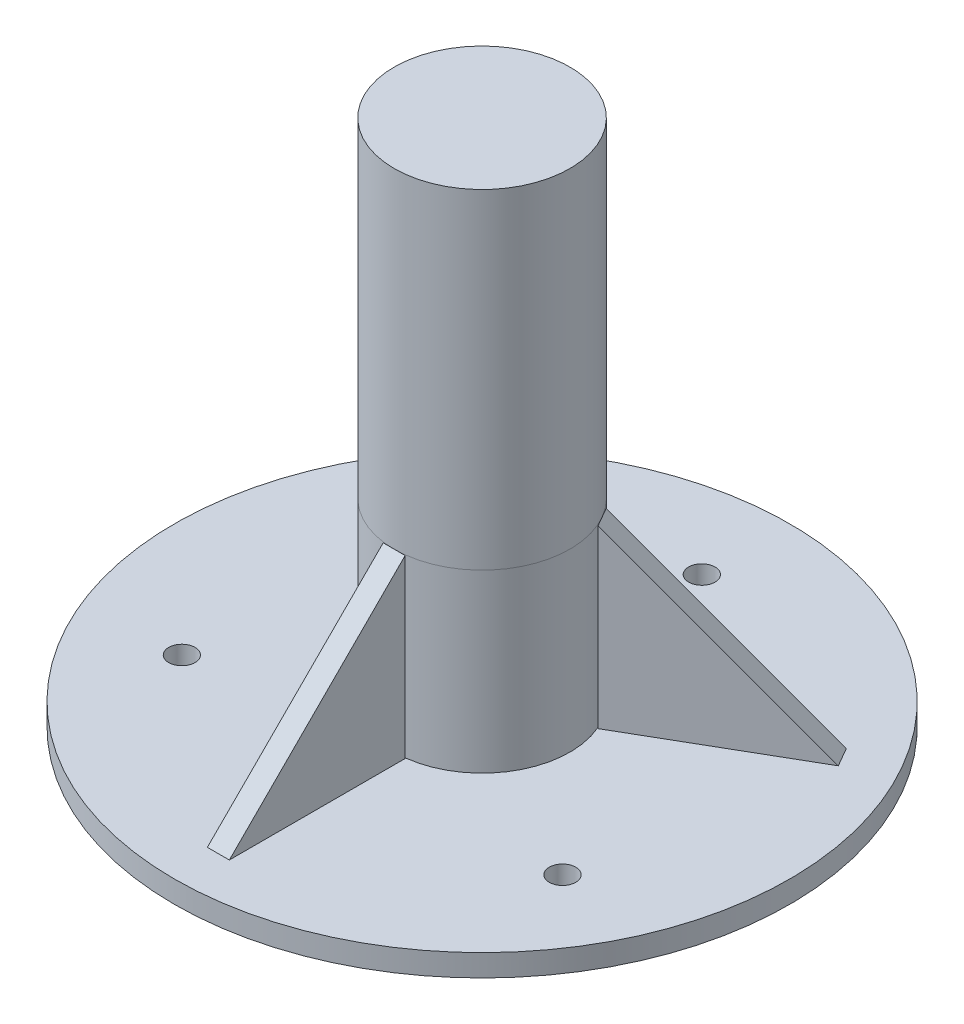
ISO-10303-21;
HEADER;
FILE_DESCRIPTION(('STEP AP214'),'2;1');
FILE_NAME('part.step','',(''),(''),'','','');
FILE_SCHEMA(('AUTOMOTIVE_DESIGN { 1 0 10303 214 1 1 1 1 }'));
ENDSEC;
DATA;
#1=APPLICATION_CONTEXT('core data for automotive mechanical design processes');
#2=APPLICATION_PROTOCOL_DEFINITION('international standard','automotive_design',2000,#1);
#3=PRODUCT_CONTEXT('',#1,'mechanical');
#4=PRODUCT('Part','Part','',(#3));
#5=PRODUCT_RELATED_PRODUCT_CATEGORY('part','',(#4));
#6=PRODUCT_DEFINITION_FORMATION('','',#4);
#7=PRODUCT_DEFINITION_CONTEXT('part definition',#1,'design');
#8=PRODUCT_DEFINITION('design','',#6,#7);
#9=PRODUCT_DEFINITION_SHAPE('','',#8);
#10=(LENGTH_UNIT() NAMED_UNIT(*) SI_UNIT(.MILLI.,.METRE.));
#11=(NAMED_UNIT(*) PLANE_ANGLE_UNIT() SI_UNIT($,.RADIAN.));
#12=(NAMED_UNIT(*) SI_UNIT($,.STERADIAN.) SOLID_ANGLE_UNIT());
#13=UNCERTAINTY_MEASURE_WITH_UNIT(LENGTH_MEASURE(1.E-05),#10,'distance_accuracy_value','');
#14=(GEOMETRIC_REPRESENTATION_CONTEXT(3) GLOBAL_UNCERTAINTY_ASSIGNED_CONTEXT((#13)) GLOBAL_UNIT_ASSIGNED_CONTEXT((#10,
#11,#12)) REPRESENTATION_CONTEXT('',''));
#15=CARTESIAN_POINT('',(0.,0.,0.));
#16=DIRECTION('',(0.,0.,1.));
#17=DIRECTION('',(1.,0.,0.));
#18=AXIS2_PLACEMENT_3D('',#15,#16,#17);
#19=CARTESIAN_POINT('',(-2.5,40.,20.));
#20=DIRECTION('',(0.,0.707106781186544,0.707106781186551));
#21=DIRECTION('',(0.,-0.707106781186551,0.707106781186544));
#22=AXIS2_PLACEMENT_3D('',#19,#20,#21);
#23=PLANE('',#22);
#24=DIRECTION('',(1.,0.,0.));
#25=VECTOR('',#24,1.);
#26=CARTESIAN_POINT('',(-2.5,0.,59.9999999999996));
#27=LINE('',#26,#25);
#28=CARTESIAN_POINT('',(-2.5,0.,59.9999999999996));
#29=VERTEX_POINT('',#28);
#30=CARTESIAN_POINT('',(2.5,0.,59.9999999999996));
#31=VERTEX_POINT('',#30);
#32=EDGE_CURVE('E48',#29,#31,#27,.T.);
#33=ORIENTED_EDGE('',*,*,#32,.T.);
#34=DIRECTION('',(0.,-0.707106781186551,0.707106781186544));
#35=VECTOR('',#34,1.);
#36=CARTESIAN_POINT('',(2.5,40.,20.));
#37=LINE('',#36,#35);
#38=CARTESIAN_POINT('',(2.5,40.,20.));
#39=VERTEX_POINT('',#38);
#40=EDGE_CURVE('E79',#39,#31,#37,.T.);
#41=ORIENTED_EDGE('',*,*,#40,.F.);
#42=DIRECTION('',(1.,0.,0.));
#43=VECTOR('',#42,1.);
#44=CARTESIAN_POINT('',(-2.5,40.,20.));
#45=LINE('',#44,#43);
#46=CARTESIAN_POINT('',(-2.5,40.,20.));
#47=VERTEX_POINT('',#46);
#48=EDGE_CURVE('E12',#47,#39,#45,.T.);
#49=ORIENTED_EDGE('',*,*,#48,.F.);
#50=DIRECTION('',(0.,-0.707106781186551,0.707106781186544));
#51=VECTOR('',#50,1.);
#52=CARTESIAN_POINT('',(-2.5,40.,20.));
#53=LINE('',#52,#51);
#54=EDGE_CURVE('E80',#47,#29,#53,.T.);
#55=ORIENTED_EDGE('',*,*,#54,.T.);
#56=EDGE_LOOP('',(#33,#41,#49,#55));
#57=FACE_BOUND('',#56,.T.);
#58=ADVANCED_FACE('F45',(#57),#23,.T.);
#59=CARTESIAN_POINT('',(-2.5,0.,20.));
#60=DIRECTION('',(0.,0.,-1.));
#61=DIRECTION('',(-1.,0.,0.));
#62=AXIS2_PLACEMENT_3D('',#59,#60,#61);
#63=PLANE('',#62);
#64=ORIENTED_EDGE('',*,*,#48,.T.);
#65=DIRECTION('',(0.,1.,0.));
#66=VECTOR('',#65,1.);
#67=CARTESIAN_POINT('',(2.5,0.,20.));
#68=LINE('',#67,#66);
#69=CARTESIAN_POINT('',(2.5,0.,20.));
#70=VERTEX_POINT('',#69);
#71=EDGE_CURVE('E89',#70,#39,#68,.T.);
#72=ORIENTED_EDGE('',*,*,#71,.F.);
#73=DIRECTION('',(1.,0.,0.));
#74=VECTOR('',#73,1.);
#75=CARTESIAN_POINT('',(-2.5,0.,20.));
#76=LINE('',#75,#74);
#77=CARTESIAN_POINT('',(-2.5,0.,20.));
#78=VERTEX_POINT('',#77);
#79=EDGE_CURVE('E53',#78,#70,#76,.T.);
#80=ORIENTED_EDGE('',*,*,#79,.F.);
#81=DIRECTION('',(0.,1.,0.));
#82=VECTOR('',#81,1.);
#83=CARTESIAN_POINT('',(-2.5,0.,20.));
#84=LINE('',#83,#82);
#85=EDGE_CURVE('E83',#78,#47,#84,.T.);
#86=ORIENTED_EDGE('',*,*,#85,.T.);
#87=EDGE_LOOP('',(#64,#72,#80,#86));
#88=FACE_BOUND('',#87,.T.);
#89=ADVANCED_FACE('F99',(#88),#63,.T.);
#90=CARTESIAN_POINT('',(-2.5,0.,59.9999999999996));
#91=DIRECTION('',(0.,-1.,0.));
#92=DIRECTION('',(0.,0.,-1.));
#93=AXIS2_PLACEMENT_3D('',#90,#91,#92);
#94=PLANE('',#93);
#95=ORIENTED_EDGE('',*,*,#79,.T.);
#96=DIRECTION('',(0.,0.,-1.));
#97=VECTOR('',#96,1.);
#98=CARTESIAN_POINT('',(2.5,0.,59.9999999999996));
#99=LINE('',#98,#97);
#100=EDGE_CURVE('E85',#31,#70,#99,.T.);
#101=ORIENTED_EDGE('',*,*,#100,.F.);
#102=ORIENTED_EDGE('',*,*,#32,.F.);
#103=DIRECTION('',(0.,0.,-1.));
#104=VECTOR('',#103,1.);
#105=CARTESIAN_POINT('',(-2.5,0.,59.9999999999996));
#106=LINE('',#105,#104);
#107=EDGE_CURVE('E96',#29,#78,#106,.T.);
#108=ORIENTED_EDGE('',*,*,#107,.T.);
#109=EDGE_LOOP('',(#95,#101,#102,#108));
#110=FACE_BOUND('',#109,.T.);
#111=ADVANCED_FACE('F86',(#110),#94,.T.);
#112=CARTESIAN_POINT('',(-2.5,0.,0.));
#113=DIRECTION('',(1.,0.,0.));
#114=DIRECTION('',(0.,0.,-1.));
#115=AXIS2_PLACEMENT_3D('',#112,#113,#114);
#116=PLANE('',#115);
#117=ORIENTED_EDGE('',*,*,#54,.F.);
#118=ORIENTED_EDGE('',*,*,#85,.F.);
#119=ORIENTED_EDGE('',*,*,#107,.F.);
#120=EDGE_LOOP('',(#117,#118,#119));
#121=FACE_BOUND('',#120,.T.);
#122=ADVANCED_FACE('F101',(#121),#116,.F.);
#123=CARTESIAN_POINT('',(2.5,0.,0.));
#124=DIRECTION('',(1.,0.,0.));
#125=DIRECTION('',(0.,0.,-1.));
#126=AXIS2_PLACEMENT_3D('',#123,#124,#125);
#127=PLANE('',#126);
#128=ORIENTED_EDGE('',*,*,#40,.T.);
#129=ORIENTED_EDGE('',*,*,#100,.T.);
#130=ORIENTED_EDGE('',*,*,#71,.T.);
#131=EDGE_LOOP('',(#128,#129,#130));
#132=FACE_BOUND('',#131,.T.);
#133=ADVANCED_FACE('F91',(#132),#127,.T.);
#134=CLOSED_SHELL('',(#58,#89,#111,#122,#133));
#135=MANIFOLD_SOLID_BREP('B2',#134);
#136=CARTESIAN_POINT('',(0.,115.,0.));
#137=DIRECTION('',(0.,-1.,0.));
#138=DIRECTION('',(0.,0.,-1.));
#139=AXIS2_PLACEMENT_3D('',#136,#137,#138);
#140=CYLINDRICAL_SURFACE('',#139,20.);
#141=CARTESIAN_POINT('',(0.,115.,0.));
#142=DIRECTION('',(0.,1.,0.));
#143=DIRECTION('',(0.,0.,1.));
#144=AXIS2_PLACEMENT_3D('',#141,#142,#143);
#145=CIRCLE('',#144,20.);
#146=CARTESIAN_POINT('',(0.,115.,20.));
#147=VERTEX_POINT('',#146);
#148=EDGE_CURVE('E43',#147,#147,#145,.T.);
#149=ORIENTED_EDGE('',*,*,#148,.F.);
#150=EDGE_LOOP('',(#149));
#151=FACE_BOUND('',#150,.T.);
#152=CARTESIAN_POINT('',(0.,40.,0.));
#153=DIRECTION('',(0.,1.,0.));
#154=DIRECTION('',(0.,0.,1.));
#155=AXIS2_PLACEMENT_3D('',#152,#153,#154);
#156=CIRCLE('',#155,20.);
#157=CARTESIAN_POINT('',(-17.3205080756887,40.,-10.0000000000001));
#158=VERTEX_POINT('',#157);
#159=CARTESIAN_POINT('',(17.3205080756889,40.,-9.99999999999984));
#160=VERTEX_POINT('',#159);
#161=EDGE_CURVE('E153',#158,#160,#156,.T.);
#162=ORIENTED_EDGE('',*,*,#161,.T.);
#163=EDGE_CURVE('E163',#160,#158,#156,.T.);
#164=ORIENTED_EDGE('',*,*,#163,.T.);
#165=EDGE_LOOP('',(#162,#164));
#166=FACE_BOUND('',#165,.T.);
#167=ADVANCED_FACE('F150',(#151,#166),#140,.T.);
#168=CARTESIAN_POINT('',(0.,115.,0.));
#169=DIRECTION('',(0.,1.,0.));
#170=DIRECTION('',(0.,0.,1.));
#171=AXIS2_PLACEMENT_3D('',#168,#169,#170);
#172=PLANE('',#171);
#173=ORIENTED_EDGE('',*,*,#148,.T.);
#174=EDGE_LOOP('',(#173));
#175=FACE_BOUND('',#174,.T.);
#176=ADVANCED_FACE('F168',(#175),#172,.T.);
#177=CARTESIAN_POINT('',(0.,40.,0.));
#178=DIRECTION('',(0.,1.,0.));
#179=DIRECTION('',(0.,0.,1.));
#180=AXIS2_PLACEMENT_3D('',#177,#178,#179);
#181=PLANE('',#180);
#182=ORIENTED_EDGE('',*,*,#161,.F.);
#183=ORIENTED_EDGE('',*,*,#163,.F.);
#184=EDGE_LOOP('',(#182,#183));
#185=FACE_BOUND('',#184,.T.);
#186=ADVANCED_FACE('F166',(#185),#181,.F.);
#187=CLOSED_SHELL('',(#167,#176,#186));
#188=MANIFOLD_SOLID_BREP('B6',#187);
#189=CARTESIAN_POINT('',(0.,40.,0.));
#190=DIRECTION('',(0.,-1.,0.));
#191=DIRECTION('',(0.,0.,-1.));
#192=AXIS2_PLACEMENT_3D('',#189,#190,#191);
#193=CYLINDRICAL_SURFACE('',#192,20.);
#194=CARTESIAN_POINT('',(0.,0.,0.));
#195=DIRECTION('',(0.,1.,0.));
#196=DIRECTION('',(0.,0.,1.));
#197=AXIS2_PLACEMENT_3D('',#194,#195,#196);
#198=CIRCLE('',#197,20.);
#199=CARTESIAN_POINT('',(0.,0.,20.));
#200=VERTEX_POINT('',#199);
#201=EDGE_CURVE('E207',#200,#200,#198,.T.);
#202=ORIENTED_EDGE('',*,*,#201,.T.);
#203=EDGE_LOOP('',(#202));
#204=FACE_BOUND('',#203,.T.);
#205=CARTESIAN_POINT('',(0.,40.,0.));
#206=DIRECTION('',(0.,1.,0.));
#207=DIRECTION('',(0.,0.,1.));
#208=AXIS2_PLACEMENT_3D('',#205,#206,#207);
#209=CIRCLE('',#208,20.);
#210=CARTESIAN_POINT('',(0.,40.,20.));
#211=VERTEX_POINT('',#210);
#212=EDGE_CURVE('E149',#211,#211,#209,.T.);
#213=ORIENTED_EDGE('',*,*,#212,.F.);
#214=EDGE_LOOP('',(#213));
#215=FACE_BOUND('',#214,.T.);
#216=ADVANCED_FACE('F204',(#204,#215),#193,.T.);
#217=CARTESIAN_POINT('',(0.,40.,0.));
#218=DIRECTION('',(0.,1.,0.));
#219=DIRECTION('',(0.,0.,1.));
#220=AXIS2_PLACEMENT_3D('',#217,#218,#219);
#221=PLANE('',#220);
#222=ORIENTED_EDGE('',*,*,#212,.T.);
#223=EDGE_LOOP('',(#222));
#224=FACE_BOUND('',#223,.T.);
#225=ADVANCED_FACE('F220',(#224),#221,.T.);
#226=CARTESIAN_POINT('',(0.,0.,0.));
#227=DIRECTION('',(0.,1.,0.));
#228=DIRECTION('',(0.,0.,1.));
#229=AXIS2_PLACEMENT_3D('',#226,#227,#228);
#230=PLANE('',#229);
#231=ORIENTED_EDGE('',*,*,#201,.F.);
#232=EDGE_LOOP('',(#231));
#233=FACE_BOUND('',#232,.T.);
#234=ADVANCED_FACE('F218',(#233),#230,.F.);
#235=CLOSED_SHELL('',(#216,#225,#234));
#236=MANIFOLD_SOLID_BREP('B37',#235);
#237=CARTESIAN_POINT('',(0.,0.,0.));
#238=DIRECTION('',(0.,1.,0.));
#239=DIRECTION('',(0.,0.,1.));
#240=AXIS2_PLACEMENT_3D('',#237,#238,#239);
#241=PLANE('',#240);
#242=CARTESIAN_POINT('',(-43.3012701892218,0.,25.0000000000002));
#243=DIRECTION('',(0.,1.,0.));
#244=DIRECTION('',(0.,0.,1.));
#245=AXIS2_PLACEMENT_3D('',#242,#243,#244);
#246=CIRCLE('',#245,3.);
#247=CARTESIAN_POINT('',(-43.3012701892218,0.,28.0000000000002));
#248=VERTEX_POINT('',#247);
#249=EDGE_CURVE('E415',#248,#248,#246,.T.);
#250=ORIENTED_EDGE('',*,*,#249,.F.);
#251=EDGE_LOOP('',(#250));
#252=FACE_BOUND('',#251,.T.);
#253=CARTESIAN_POINT('',(0.,0.,-50.));
#254=DIRECTION('',(0.,1.,0.));
#255=DIRECTION('',(0.,0.,1.));
#256=AXIS2_PLACEMENT_3D('',#253,#254,#255);
#257=CIRCLE('',#256,2.99999999999999);
#258=CARTESIAN_POINT('',(0.,0.,-47.));
#259=VERTEX_POINT('',#258);
#260=EDGE_CURVE('E420',#259,#259,#257,.T.);
#261=ORIENTED_EDGE('',*,*,#260,.F.);
#262=EDGE_LOOP('',(#261));
#263=FACE_BOUND('',#262,.T.);
#264=CARTESIAN_POINT('',(43.3012701892218,0.,25.0000000000002));
#265=DIRECTION('',(0.,1.,0.));
#266=DIRECTION('',(0.,0.,1.));
#267=AXIS2_PLACEMENT_3D('',#264,#265,#266);
#268=CIRCLE('',#267,3.);
#269=CARTESIAN_POINT('',(43.3012701892218,0.,28.0000000000002));
#270=VERTEX_POINT('',#269);
#271=EDGE_CURVE('E428',#270,#270,#268,.T.);
#272=ORIENTED_EDGE('',*,*,#271,.F.);
#273=EDGE_LOOP('',(#272));
#274=FACE_BOUND('',#273,.T.);
#275=CARTESIAN_POINT('',(0.,0.,0.));
#276=DIRECTION('',(0.,1.,0.));
#277=DIRECTION('',(0.,0.,1.));
#278=AXIS2_PLACEMENT_3D('',#275,#276,#277);
#279=CIRCLE('',#278,70.);
#280=CARTESIAN_POINT('',(0.,0.,70.));
#281=VERTEX_POINT('',#280);
#282=EDGE_CURVE('E248',#281,#281,#279,.T.);
#283=ORIENTED_EDGE('',*,*,#282,.T.);
#284=EDGE_LOOP('',(#283));
#285=FACE_BOUND('',#284,.T.);
#286=DIRECTION('',(-0.500000000000004,0.,0.866025403784436));
#287=VECTOR('',#286,1.);
#288=CARTESIAN_POINT('',(-50.7115242270658,0.,-32.1650635094611));
#289=LINE('',#288,#287);
#290=CARTESIAN_POINT('',(-50.7115242270658,0.,-32.1650635094611));
#291=VERTEX_POINT('',#290);
#292=CARTESIAN_POINT('',(-53.2115242270658,0.,-27.8349364905389));
#293=VERTEX_POINT('',#292);
#294=EDGE_CURVE('E323',#291,#293,#289,.T.);
#295=ORIENTED_EDGE('',*,*,#294,.F.);
#296=DIRECTION('',(0.866025403784436,0.,0.500000000000004));
#297=VECTOR('',#296,1.);
#298=CARTESIAN_POINT('',(-50.7115242270658,0.,-32.1650635094611));
#299=LINE('',#298,#297);
#300=CARTESIAN_POINT('',(-16.0705080756887,0.,-12.1650635094612));
#301=VERTEX_POINT('',#300);
#302=EDGE_CURVE('E346',#291,#301,#299,.T.);
#303=ORIENTED_EDGE('',*,*,#302,.T.);
#304=DIRECTION('',(-0.500000000000004,0.,0.866025403784436));
#305=VECTOR('',#304,1.);
#306=CARTESIAN_POINT('',(-16.0705080756887,0.,-12.1650635094612));
#307=LINE('',#306,#305);
#308=CARTESIAN_POINT('',(-18.5705080756887,0.,-7.83493649053899));
#309=VERTEX_POINT('',#308);
#310=EDGE_CURVE('E338',#301,#309,#307,.T.);
#311=ORIENTED_EDGE('',*,*,#310,.T.);
#312=DIRECTION('',(0.866025403784436,0.,0.500000000000004));
#313=VECTOR('',#312,1.);
#314=CARTESIAN_POINT('',(-53.2115242270658,0.,-27.8349364905389));
#315=LINE('',#314,#313);
#316=EDGE_CURVE('E343',#293,#309,#315,.T.);
#317=ORIENTED_EDGE('',*,*,#316,.F.);
#318=EDGE_LOOP('',(#295,#303,#311,#317));
#319=FACE_BOUND('',#318,.T.);
#320=DIRECTION('',(-0.499999999999992,0.,-0.866025403784443));
#321=VECTOR('',#320,1.);
#322=CARTESIAN_POINT('',(53.2115242270662,0.,-27.8349364905382));
#323=LINE('',#322,#321);
#324=CARTESIAN_POINT('',(53.2115242270662,0.,-27.8349364905382));
#325=VERTEX_POINT('',#324);
#326=CARTESIAN_POINT('',(50.7115242270662,0.,-32.1650635094604));
#327=VERTEX_POINT('',#326);
#328=EDGE_CURVE('E259',#325,#327,#323,.T.);
#329=ORIENTED_EDGE('',*,*,#328,.F.);
#330=DIRECTION('',(-0.866025403784443,0.,0.499999999999992));
#331=VECTOR('',#330,1.);
#332=CARTESIAN_POINT('',(53.2115242270662,0.,-27.8349364905382));
#333=LINE('',#332,#331);
#334=CARTESIAN_POINT('',(18.5705080756888,0.,-7.83493649053873));
#335=VERTEX_POINT('',#334);
#336=EDGE_CURVE('E264',#325,#335,#333,.T.);
#337=ORIENTED_EDGE('',*,*,#336,.T.);
#338=DIRECTION('',(-0.499999999999992,0.,-0.866025403784443));
#339=VECTOR('',#338,1.);
#340=CARTESIAN_POINT('',(18.5705080756888,0.,-7.83493649053873));
#341=LINE('',#340,#339);
#342=CARTESIAN_POINT('',(16.0705080756889,0.,-12.1650635094609));
#343=VERTEX_POINT('',#342);
#344=EDGE_CURVE('E315',#335,#343,#341,.T.);
#345=ORIENTED_EDGE('',*,*,#344,.T.);
#346=DIRECTION('',(-0.866025403784443,0.,0.499999999999992));
#347=VECTOR('',#346,1.);
#348=CARTESIAN_POINT('',(50.7115242270662,0.,-32.1650635094604));
#349=LINE('',#348,#347);
#350=EDGE_CURVE('E314',#327,#343,#349,.T.);
#351=ORIENTED_EDGE('',*,*,#350,.F.);
#352=EDGE_LOOP('',(#329,#337,#345,#351));
#353=FACE_BOUND('',#352,.T.);
#354=ADVANCED_FACE('F244',(#252,#263,#274,#285,#319,#353),#241,.T.);
#355=CARTESIAN_POINT('',(0.,-5.,0.));
#356=DIRECTION('',(0.,1.,0.));
#357=DIRECTION('',(0.,0.,1.));
#358=AXIS2_PLACEMENT_3D('',#355,#356,#357);
#359=CYLINDRICAL_SURFACE('',#358,70.);
#360=CARTESIAN_POINT('',(0.,-5.,0.));
#361=DIRECTION('',(0.,1.,0.));
#362=DIRECTION('',(0.,0.,1.));
#363=AXIS2_PLACEMENT_3D('',#360,#361,#362);
#364=CIRCLE('',#363,70.);
#365=CARTESIAN_POINT('',(0.,-5.,70.));
#366=VERTEX_POINT('',#365);
#367=EDGE_CURVE('E202',#366,#366,#364,.T.);
#368=ORIENTED_EDGE('',*,*,#367,.T.);
#369=EDGE_LOOP('',(#368));
#370=FACE_BOUND('',#369,.T.);
#371=ORIENTED_EDGE('',*,*,#282,.F.);
#372=EDGE_LOOP('',(#371));
#373=FACE_BOUND('',#372,.T.);
#374=ADVANCED_FACE('F246',(#370,#373),#359,.T.);
#375=CARTESIAN_POINT('',(0.,-5.,0.));
#376=DIRECTION('',(0.,1.,0.));
#377=DIRECTION('',(0.,0.,1.));
#378=AXIS2_PLACEMENT_3D('',#375,#376,#377);
#379=PLANE('',#378);
#380=CARTESIAN_POINT('',(-43.3012701892218,-5.,25.0000000000002));
#381=DIRECTION('',(0.,1.,0.));
#382=DIRECTION('',(0.,0.,1.));
#383=AXIS2_PLACEMENT_3D('',#380,#381,#382);
#384=CIRCLE('',#383,3.);
#385=CARTESIAN_POINT('',(-43.3012701892218,-5.,28.0000000000002));
#386=VERTEX_POINT('',#385);
#387=EDGE_CURVE('E413',#386,#386,#384,.T.);
#388=ORIENTED_EDGE('',*,*,#387,.T.);
#389=EDGE_LOOP('',(#388));
#390=FACE_BOUND('',#389,.T.);
#391=CARTESIAN_POINT('',(0.,-5.,-50.));
#392=DIRECTION('',(0.,1.,0.));
#393=DIRECTION('',(0.,0.,1.));
#394=AXIS2_PLACEMENT_3D('',#391,#392,#393);
#395=CIRCLE('',#394,2.99999999999999);
#396=CARTESIAN_POINT('',(0.,-5.,-47.));
#397=VERTEX_POINT('',#396);
#398=EDGE_CURVE('E416',#397,#397,#395,.T.);
#399=ORIENTED_EDGE('',*,*,#398,.T.);
#400=EDGE_LOOP('',(#399));
#401=FACE_BOUND('',#400,.T.);
#402=CARTESIAN_POINT('',(43.3012701892218,-5.,25.0000000000002));
#403=DIRECTION('',(0.,1.,0.));
#404=DIRECTION('',(0.,0.,1.));
#405=AXIS2_PLACEMENT_3D('',#402,#403,#404);
#406=CIRCLE('',#405,3.);
#407=CARTESIAN_POINT('',(43.3012701892218,-5.,28.0000000000002));
#408=VERTEX_POINT('',#407);
#409=EDGE_CURVE('E425',#408,#408,#406,.T.);
#410=ORIENTED_EDGE('',*,*,#409,.T.);
#411=EDGE_LOOP('',(#410));
#412=FACE_BOUND('',#411,.T.);
#413=ORIENTED_EDGE('',*,*,#367,.F.);
#414=EDGE_LOOP('',(#413));
#415=FACE_BOUND('',#414,.T.);
#416=ADVANCED_FACE('F355',(#390,#401,#412,#415),#379,.F.);
#417=CARTESIAN_POINT('',(-16.0705080756887,40.,-12.1650635094612));
#418=DIRECTION('',(-0.612372435695796,0.707106781186544,-0.353553390593279));
#419=DIRECTION('',(-0.61237243569579,-0.707106781186551,-0.353553390593275));
#420=AXIS2_PLACEMENT_3D('',#417,#418,#419);
#421=PLANE('',#420);
#422=ORIENTED_EDGE('',*,*,#294,.T.);
#423=DIRECTION('',(-0.61237243569579,-0.707106781186551,-0.353553390593275));
#424=VECTOR('',#423,1.);
#425=CARTESIAN_POINT('',(-18.5705080756887,40.,-7.83493649053899));
#426=LINE('',#425,#424);
#427=CARTESIAN_POINT('',(-18.5705080756887,40.,-7.83493649053899));
#428=VERTEX_POINT('',#427);
#429=EDGE_CURVE('E326',#428,#293,#426,.T.);
#430=ORIENTED_EDGE('',*,*,#429,.F.);
#431=DIRECTION('',(-0.500000000000004,0.,0.866025403784436));
#432=VECTOR('',#431,1.);
#433=CARTESIAN_POINT('',(-16.0705080756887,40.,-12.1650635094612));
#434=LINE('',#433,#432);
#435=CARTESIAN_POINT('',(-16.0705080756887,40.,-12.1650635094612));
#436=VERTEX_POINT('',#435);
#437=EDGE_CURVE('E329',#436,#428,#434,.T.);
#438=ORIENTED_EDGE('',*,*,#437,.F.);
#439=DIRECTION('',(-0.61237243569579,-0.707106781186551,-0.353553390593275));
#440=VECTOR('',#439,1.);
#441=CARTESIAN_POINT('',(-16.0705080756887,40.,-12.1650635094612));
#442=LINE('',#441,#440);
#443=EDGE_CURVE('E332',#436,#291,#442,.T.);
#444=ORIENTED_EDGE('',*,*,#443,.T.);
#445=EDGE_LOOP('',(#422,#430,#438,#444));
#446=FACE_BOUND('',#445,.T.);
#447=ADVANCED_FACE('F361',(#446),#421,.T.);
#448=CARTESIAN_POINT('',(-16.0705080756887,0.,-12.1650635094612));
#449=DIRECTION('',(0.866025403784436,0.,0.500000000000004));
#450=DIRECTION('',(0.500000000000004,0.,-0.866025403784436));
#451=AXIS2_PLACEMENT_3D('',#448,#449,#450);
#452=PLANE('',#451);
#453=ORIENTED_EDGE('',*,*,#437,.T.);
#454=DIRECTION('',(0.,1.,0.));
#455=VECTOR('',#454,1.);
#456=CARTESIAN_POINT('',(-18.5705080756887,0.,-7.83493649053899));
#457=LINE('',#456,#455);
#458=EDGE_CURVE('E335',#309,#428,#457,.T.);
#459=ORIENTED_EDGE('',*,*,#458,.F.);
#460=ORIENTED_EDGE('',*,*,#310,.F.);
#461=DIRECTION('',(0.,1.,0.));
#462=VECTOR('',#461,1.);
#463=CARTESIAN_POINT('',(-16.0705080756887,0.,-12.1650635094612));
#464=LINE('',#463,#462);
#465=EDGE_CURVE('E340',#301,#436,#464,.T.);
#466=ORIENTED_EDGE('',*,*,#465,.T.);
#467=EDGE_LOOP('',(#453,#459,#460,#466));
#468=FACE_BOUND('',#467,.T.);
#469=ADVANCED_FACE('F379',(#468),#452,.T.);
#470=CARTESIAN_POINT('',(1.25000000000001,0.,-2.16506350946109));
#471=DIRECTION('',(-0.500000000000004,0.,0.866025403784436));
#472=DIRECTION('',(0.866025403784436,0.,0.500000000000004));
#473=AXIS2_PLACEMENT_3D('',#470,#471,#472);
#474=PLANE('',#473);
#475=ORIENTED_EDGE('',*,*,#443,.F.);
#476=ORIENTED_EDGE('',*,*,#465,.F.);
#477=ORIENTED_EDGE('',*,*,#302,.F.);
#478=EDGE_LOOP('',(#475,#476,#477));
#479=FACE_BOUND('',#478,.T.);
#480=ADVANCED_FACE('F375',(#479),#474,.F.);
#481=CARTESIAN_POINT('',(-1.25000000000001,0.,2.16506350946109));
#482=DIRECTION('',(-0.500000000000004,0.,0.866025403784436));
#483=DIRECTION('',(0.866025403784436,0.,0.500000000000004));
#484=AXIS2_PLACEMENT_3D('',#481,#482,#483);
#485=PLANE('',#484);
#486=ORIENTED_EDGE('',*,*,#429,.T.);
#487=ORIENTED_EDGE('',*,*,#316,.T.);
#488=ORIENTED_EDGE('',*,*,#458,.T.);
#489=EDGE_LOOP('',(#486,#487,#488));
#490=FACE_BOUND('',#489,.T.);
#491=ADVANCED_FACE('F364',(#490),#485,.T.);
#492=CARTESIAN_POINT('',(18.5705080756888,40.,-7.83493649053873));
#493=DIRECTION('',(0.612372435695801,0.707106781186544,-0.35355339059327));
#494=DIRECTION('',(0.612372435695794,-0.707106781186551,-0.353553390593266));
#495=AXIS2_PLACEMENT_3D('',#492,#493,#494);
#496=PLANE('',#495);
#497=ORIENTED_EDGE('',*,*,#328,.T.);
#498=DIRECTION('',(0.612372435695794,-0.707106781186551,-0.353553390593266));
#499=VECTOR('',#498,1.);
#500=CARTESIAN_POINT('',(16.0705080756889,40.,-12.1650635094609));
#501=LINE('',#500,#499);
#502=CARTESIAN_POINT('',(16.0705080756889,40.,-12.1650635094609));
#503=VERTEX_POINT('',#502);
#504=EDGE_CURVE('E295',#503,#327,#501,.T.);
#505=ORIENTED_EDGE('',*,*,#504,.F.);
#506=DIRECTION('',(-0.499999999999992,0.,-0.866025403784443));
#507=VECTOR('',#506,1.);
#508=CARTESIAN_POINT('',(18.5705080756888,40.,-7.83493649053873));
#509=LINE('',#508,#507);
#510=CARTESIAN_POINT('',(18.5705080756888,40.,-7.83493649053873));
#511=VERTEX_POINT('',#510);
#512=EDGE_CURVE('E298',#511,#503,#509,.T.);
#513=ORIENTED_EDGE('',*,*,#512,.F.);
#514=DIRECTION('',(0.612372435695794,-0.707106781186551,-0.353553390593266));
#515=VECTOR('',#514,1.);
#516=CARTESIAN_POINT('',(18.5705080756888,40.,-7.83493649053873));
#517=LINE('',#516,#515);
#518=EDGE_CURVE('E311',#511,#325,#517,.T.);
#519=ORIENTED_EDGE('',*,*,#518,.T.);
#520=EDGE_LOOP('',(#497,#505,#513,#519));
#521=FACE_BOUND('',#520,.T.);
#522=ADVANCED_FACE('F297',(#521),#496,.T.);
#523=CARTESIAN_POINT('',(18.5705080756888,0.,-7.83493649053873));
#524=DIRECTION('',(-0.866025403784443,0.,0.499999999999992));
#525=DIRECTION('',(0.499999999999992,0.,0.866025403784443));
#526=AXIS2_PLACEMENT_3D('',#523,#524,#525);
#527=PLANE('',#526);
#528=ORIENTED_EDGE('',*,*,#512,.T.);
#529=DIRECTION('',(0.,1.,0.));
#530=VECTOR('',#529,1.);
#531=CARTESIAN_POINT('',(16.0705080756889,0.,-12.1650635094609));
#532=LINE('',#531,#530);
#533=EDGE_CURVE('E308',#343,#503,#532,.T.);
#534=ORIENTED_EDGE('',*,*,#533,.F.);
#535=ORIENTED_EDGE('',*,*,#344,.F.);
#536=DIRECTION('',(0.,1.,0.));
#537=VECTOR('',#536,1.);
#538=CARTESIAN_POINT('',(18.5705080756888,0.,-7.83493649053873));
#539=LINE('',#538,#537);
#540=EDGE_CURVE('E310',#335,#511,#539,.T.);
#541=ORIENTED_EDGE('',*,*,#540,.T.);
#542=EDGE_LOOP('',(#528,#534,#535,#541));
#543=FACE_BOUND('',#542,.T.);
#544=ADVANCED_FACE('F307',(#543),#527,.T.);
#545=CARTESIAN_POINT('',(1.24999999999998,0.,2.16506350946111));
#546=DIRECTION('',(-0.499999999999992,0.,-0.866025403784443));
#547=DIRECTION('',(-0.866025403784443,0.,0.499999999999992));
#548=AXIS2_PLACEMENT_3D('',#545,#546,#547);
#549=PLANE('',#548);
#550=ORIENTED_EDGE('',*,*,#518,.F.);
#551=ORIENTED_EDGE('',*,*,#540,.F.);
#552=ORIENTED_EDGE('',*,*,#336,.F.);
#553=EDGE_LOOP('',(#550,#551,#552));
#554=FACE_BOUND('',#553,.T.);
#555=ADVANCED_FACE('F390',(#554),#549,.F.);
#556=CARTESIAN_POINT('',(-1.24999999999998,0.,-2.16506350946111));
#557=DIRECTION('',(-0.499999999999992,0.,-0.866025403784443));
#558=DIRECTION('',(-0.866025403784443,0.,0.499999999999992));
#559=AXIS2_PLACEMENT_3D('',#556,#557,#558);
#560=PLANE('',#559);
#561=ORIENTED_EDGE('',*,*,#504,.T.);
#562=ORIENTED_EDGE('',*,*,#350,.T.);
#563=ORIENTED_EDGE('',*,*,#533,.T.);
#564=EDGE_LOOP('',(#561,#562,#563));
#565=FACE_BOUND('',#564,.T.);
#566=ADVANCED_FACE('F313',(#565),#560,.T.);
#567=CARTESIAN_POINT('',(43.3012701892218,-5.,25.0000000000002));
#568=DIRECTION('',(0.,1.,0.));
#569=DIRECTION('',(0.,0.,1.));
#570=AXIS2_PLACEMENT_3D('',#567,#568,#569);
#571=CYLINDRICAL_SURFACE('',#570,3.);
#572=ORIENTED_EDGE('',*,*,#409,.F.);
#573=EDGE_LOOP('',(#572));
#574=FACE_BOUND('',#573,.T.);
#575=ORIENTED_EDGE('',*,*,#271,.T.);
#576=EDGE_LOOP('',(#575));
#577=FACE_BOUND('',#576,.T.);
#578=ADVANCED_FACE('F389',(#574,#577),#571,.F.);
#579=CARTESIAN_POINT('',(0.,-5.,-50.));
#580=DIRECTION('',(0.,1.,0.));
#581=DIRECTION('',(0.,0.,1.));
#582=AXIS2_PLACEMENT_3D('',#579,#580,#581);
#583=CYLINDRICAL_SURFACE('',#582,2.99999999999999);
#584=ORIENTED_EDGE('',*,*,#398,.F.);
#585=EDGE_LOOP('',(#584));
#586=FACE_BOUND('',#585,.T.);
#587=ORIENTED_EDGE('',*,*,#260,.T.);
#588=EDGE_LOOP('',(#587));
#589=FACE_BOUND('',#588,.T.);
#590=ADVANCED_FACE('F400',(#586,#589),#583,.F.);
#591=CARTESIAN_POINT('',(-43.3012701892218,-5.,25.0000000000002));
#592=DIRECTION('',(0.,1.,0.));
#593=DIRECTION('',(0.,0.,1.));
#594=AXIS2_PLACEMENT_3D('',#591,#592,#593);
#595=CYLINDRICAL_SURFACE('',#594,3.);
#596=ORIENTED_EDGE('',*,*,#387,.F.);
#597=EDGE_LOOP('',(#596));
#598=FACE_BOUND('',#597,.T.);
#599=ORIENTED_EDGE('',*,*,#249,.T.);
#600=EDGE_LOOP('',(#599));
#601=FACE_BOUND('',#600,.T.);
#602=ADVANCED_FACE('F404',(#598,#601),#595,.F.);
#603=CLOSED_SHELL('',(#354,#374,#416,#447,#469,#480,#491,#522,#544,#555,#566,#578,#590,#602));
#604=MANIFOLD_SOLID_BREP('B144',#603);
#605=ADVANCED_BREP_SHAPE_REPRESENTATION('',(#18,#135,#188,#236,#604),#14);
#606=SHAPE_DEFINITION_REPRESENTATION(#9,#605);
ENDSEC;
END-ISO-10303-21;
